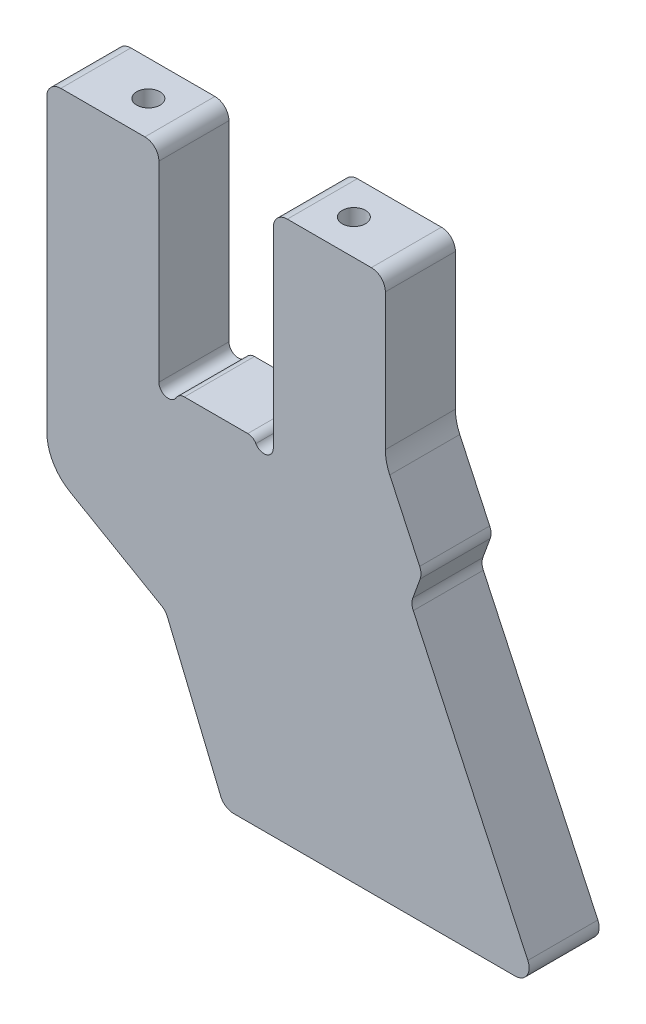
ISO-10303-21;
HEADER;
FILE_DESCRIPTION(('STEP AP214'),'2;1');
FILE_NAME('part.step','',(''),(''),'','','');
FILE_SCHEMA(('AUTOMOTIVE_DESIGN { 1 0 10303 214 1 1 1 1 }'));
ENDSEC;
DATA;
#1=APPLICATION_CONTEXT('core data for automotive mechanical design processes');
#2=APPLICATION_PROTOCOL_DEFINITION('international standard','automotive_design',2000,#1);
#3=PRODUCT_CONTEXT('',#1,'mechanical');
#4=PRODUCT('Part','Part','',(#3));
#5=PRODUCT_RELATED_PRODUCT_CATEGORY('part','',(#4));
#6=PRODUCT_DEFINITION_FORMATION('','',#4);
#7=PRODUCT_DEFINITION_CONTEXT('part definition',#1,'design');
#8=PRODUCT_DEFINITION('design','',#6,#7);
#9=PRODUCT_DEFINITION_SHAPE('','',#8);
#10=(LENGTH_UNIT() NAMED_UNIT(*) SI_UNIT(.MILLI.,.METRE.));
#11=(NAMED_UNIT(*) PLANE_ANGLE_UNIT() SI_UNIT($,.RADIAN.));
#12=(NAMED_UNIT(*) SI_UNIT($,.STERADIAN.) SOLID_ANGLE_UNIT());
#13=UNCERTAINTY_MEASURE_WITH_UNIT(LENGTH_MEASURE(1.E-05),#10,'distance_accuracy_value','');
#14=(GEOMETRIC_REPRESENTATION_CONTEXT(3) GLOBAL_UNCERTAINTY_ASSIGNED_CONTEXT((#13)) GLOBAL_UNIT_ASSIGNED_CONTEXT((#10,
#11,#12)) REPRESENTATION_CONTEXT('',''));
#15=CARTESIAN_POINT('',(0.,0.,0.));
#16=DIRECTION('',(0.,0.,1.));
#17=DIRECTION('',(1.,0.,0.));
#18=AXIS2_PLACEMENT_3D('',#15,#16,#17);
#19=CARTESIAN_POINT('',(-15.25,41.,-15.));
#20=DIRECTION('',(0.,0.,1.));
#21=DIRECTION('',(1.,0.,0.));
#22=AXIS2_PLACEMENT_3D('',#19,#20,#21);
#23=CYLINDRICAL_SURFACE('',#22,3.);
#24=CARTESIAN_POINT('',(-15.25,41.,0.));
#25=DIRECTION('',(0.,0.,1.));
#26=DIRECTION('',(1.,0.,0.));
#27=AXIS2_PLACEMENT_3D('',#24,#25,#26);
#28=CIRCLE('',#27,3.);
#29=CARTESIAN_POINT('',(-12.25,41.,0.));
#30=VERTEX_POINT('',#29);
#31=CARTESIAN_POINT('',(-15.25,44.,0.));
#32=VERTEX_POINT('',#31);
#33=EDGE_CURVE('E267',#30,#32,#28,.T.);
#34=ORIENTED_EDGE('',*,*,#33,.F.);
#35=DIRECTION('',(0.,0.,1.));
#36=VECTOR('',#35,1.);
#37=CARTESIAN_POINT('',(-12.25,41.,-15.));
#38=LINE('',#37,#36);
#39=CARTESIAN_POINT('',(-12.25,41.,-15.));
#40=VERTEX_POINT('',#39);
#41=EDGE_CURVE('E11',#40,#30,#38,.T.);
#42=ORIENTED_EDGE('',*,*,#41,.F.);
#43=CARTESIAN_POINT('',(-15.25,41.,-15.));
#44=DIRECTION('',(0.,0.,1.));
#45=DIRECTION('',(1.,0.,0.));
#46=AXIS2_PLACEMENT_3D('',#43,#44,#45);
#47=CIRCLE('',#46,3.);
#48=CARTESIAN_POINT('',(-15.25,44.,-15.));
#49=VERTEX_POINT('',#48);
#50=EDGE_CURVE('E348',#40,#49,#47,.T.);
#51=ORIENTED_EDGE('',*,*,#50,.T.);
#52=DIRECTION('',(0.,0.,1.));
#53=VECTOR('',#52,1.);
#54=CARTESIAN_POINT('',(-15.25,44.,-15.));
#55=LINE('',#54,#53);
#56=EDGE_CURVE('E50',#49,#32,#55,.T.);
#57=ORIENTED_EDGE('',*,*,#56,.T.);
#58=EDGE_LOOP('',(#34,#42,#51,#57));
#59=FACE_BOUND('',#58,.T.);
#60=ADVANCED_FACE('F47',(#59),#23,.T.);
#61=CARTESIAN_POINT('',(-12.25,41.,-15.));
#62=DIRECTION('',(1.,0.,0.));
#63=DIRECTION('',(0.,1.,0.));
#64=AXIS2_PLACEMENT_3D('',#61,#62,#63);
#65=PLANE('',#64);
#66=DIRECTION('',(0.,1.,0.));
#67=VECTOR('',#66,1.);
#68=CARTESIAN_POINT('',(-12.25,41.,0.));
#69=LINE('',#68,#67);
#70=CARTESIAN_POINT('',(-12.25,0.,0.));
#71=VERTEX_POINT('',#70);
#72=EDGE_CURVE('E346',#71,#30,#69,.T.);
#73=ORIENTED_EDGE('',*,*,#72,.F.);
#74=DIRECTION('',(0.,0.,1.));
#75=VECTOR('',#74,1.);
#76=CARTESIAN_POINT('',(-12.25,0.,-15.));
#77=LINE('',#76,#75);
#78=CARTESIAN_POINT('',(-12.25,0.,-15.));
#79=VERTEX_POINT('',#78);
#80=EDGE_CURVE('E56',#79,#71,#77,.T.);
#81=ORIENTED_EDGE('',*,*,#80,.F.);
#82=DIRECTION('',(0.,1.,0.));
#83=VECTOR('',#82,1.);
#84=CARTESIAN_POINT('',(-12.25,41.,-15.));
#85=LINE('',#84,#83);
#86=EDGE_CURVE('E257',#79,#40,#85,.T.);
#87=ORIENTED_EDGE('',*,*,#86,.T.);
#88=ORIENTED_EDGE('',*,*,#41,.T.);
#89=EDGE_LOOP('',(#73,#81,#87,#88));
#90=FACE_BOUND('',#89,.T.);
#91=ADVANCED_FACE('F400',(#90),#65,.T.);
#92=CARTESIAN_POINT('',(-10.25,0.,-15.));
#93=DIRECTION('',(0.,0.,1.));
#94=DIRECTION('',(1.,0.,0.));
#95=AXIS2_PLACEMENT_3D('',#92,#93,#94);
#96=CYLINDRICAL_SURFACE('',#95,2.);
#97=CARTESIAN_POINT('',(-10.25,0.,0.));
#98=DIRECTION('',(0.,0.,-1.));
#99=DIRECTION('',(1.,0.,0.));
#100=AXIS2_PLACEMENT_3D('',#97,#98,#99);
#101=CIRCLE('',#100,2.);
#102=CARTESIAN_POINT('',(-8.51794919243112,-1.,0.));
#103=VERTEX_POINT('',#102);
#104=EDGE_CURVE('E244',#103,#71,#101,.T.);
#105=ORIENTED_EDGE('',*,*,#104,.F.);
#106=DIRECTION('',(0.,0.,1.));
#107=VECTOR('',#106,1.);
#108=CARTESIAN_POINT('',(-8.51794919243112,-1.,-15.));
#109=LINE('',#108,#107);
#110=CARTESIAN_POINT('',(-8.51794919243112,-1.,-15.));
#111=VERTEX_POINT('',#110);
#112=EDGE_CURVE('E239',#111,#103,#109,.T.);
#113=ORIENTED_EDGE('',*,*,#112,.F.);
#114=CARTESIAN_POINT('',(-10.25,0.,-15.));
#115=DIRECTION('',(0.,0.,-1.));
#116=DIRECTION('',(1.,0.,0.));
#117=AXIS2_PLACEMENT_3D('',#114,#115,#116);
#118=CIRCLE('',#117,2.);
#119=EDGE_CURVE('E242',#111,#79,#118,.T.);
#120=ORIENTED_EDGE('',*,*,#119,.T.);
#121=ORIENTED_EDGE('',*,*,#80,.T.);
#122=EDGE_LOOP('',(#105,#113,#120,#121));
#123=FACE_BOUND('',#122,.T.);
#124=ADVANCED_FACE('F241',(#123),#96,.F.);
#125=CARTESIAN_POINT('',(-6.78589838486224,-2.,-15.));
#126=DIRECTION('',(0.,0.,1.));
#127=DIRECTION('',(1.,0.,0.));
#128=AXIS2_PLACEMENT_3D('',#125,#126,#127);
#129=CYLINDRICAL_SURFACE('',#128,2.);
#130=CARTESIAN_POINT('',(-6.78589838486224,-2.,0.));
#131=DIRECTION('',(0.,0.,1.));
#132=DIRECTION('',(-1.,0.,0.));
#133=AXIS2_PLACEMENT_3D('',#130,#131,#132);
#134=CIRCLE('',#133,2.);
#135=CARTESIAN_POINT('',(-6.78589838486224,0.,0.));
#136=VERTEX_POINT('',#135);
#137=EDGE_CURVE('E343',#136,#103,#134,.T.);
#138=ORIENTED_EDGE('',*,*,#137,.F.);
#139=DIRECTION('',(0.,0.,1.));
#140=VECTOR('',#139,1.);
#141=CARTESIAN_POINT('',(-6.78589838486224,0.,-15.));
#142=LINE('',#141,#140);
#143=CARTESIAN_POINT('',(-6.78589838486224,0.,-15.));
#144=VERTEX_POINT('',#143);
#145=EDGE_CURVE('E249',#144,#136,#142,.T.);
#146=ORIENTED_EDGE('',*,*,#145,.F.);
#147=CARTESIAN_POINT('',(-6.78589838486224,-2.,-15.));
#148=DIRECTION('',(0.,0.,1.));
#149=DIRECTION('',(-1.,0.,0.));
#150=AXIS2_PLACEMENT_3D('',#147,#148,#149);
#151=CIRCLE('',#150,2.);
#152=EDGE_CURVE('E255',#144,#111,#151,.T.);
#153=ORIENTED_EDGE('',*,*,#152,.T.);
#154=ORIENTED_EDGE('',*,*,#112,.T.);
#155=EDGE_LOOP('',(#138,#146,#153,#154));
#156=FACE_BOUND('',#155,.T.);
#157=ADVANCED_FACE('F259',(#156),#129,.T.);
#158=CARTESIAN_POINT('',(6.78589838486224,0.,-15.));
#159=DIRECTION('',(0.,1.,0.));
#160=DIRECTION('',(0.,0.,1.));
#161=AXIS2_PLACEMENT_3D('',#158,#159,#160);
#162=PLANE('',#161);
#163=DIRECTION('',(-1.,0.,0.));
#164=VECTOR('',#163,1.);
#165=CARTESIAN_POINT('',(6.78589838486224,0.,0.));
#166=LINE('',#165,#164);
#167=CARTESIAN_POINT('',(6.78589838486224,0.,0.));
#168=VERTEX_POINT('',#167);
#169=EDGE_CURVE('E340',#168,#136,#166,.T.);
#170=ORIENTED_EDGE('',*,*,#169,.F.);
#171=DIRECTION('',(0.,0.,1.));
#172=VECTOR('',#171,1.);
#173=CARTESIAN_POINT('',(6.78589838486224,0.,-15.));
#174=LINE('',#173,#172);
#175=CARTESIAN_POINT('',(6.78589838486224,0.,-15.));
#176=VERTEX_POINT('',#175);
#177=EDGE_CURVE('E352',#176,#168,#174,.T.);
#178=ORIENTED_EDGE('',*,*,#177,.F.);
#179=DIRECTION('',(-1.,0.,0.));
#180=VECTOR('',#179,1.);
#181=CARTESIAN_POINT('',(6.78589838486224,0.,-15.));
#182=LINE('',#181,#180);
#183=EDGE_CURVE('E260',#176,#144,#182,.T.);
#184=ORIENTED_EDGE('',*,*,#183,.T.);
#185=ORIENTED_EDGE('',*,*,#145,.T.);
#186=EDGE_LOOP('',(#170,#178,#184,#185));
#187=FACE_BOUND('',#186,.T.);
#188=ADVANCED_FACE('F413',(#187),#162,.T.);
#189=CARTESIAN_POINT('',(6.78589838486224,-2.,-15.));
#190=DIRECTION('',(0.,0.,1.));
#191=DIRECTION('',(1.,0.,0.));
#192=AXIS2_PLACEMENT_3D('',#189,#190,#191);
#193=CYLINDRICAL_SURFACE('',#192,2.);
#194=CARTESIAN_POINT('',(6.78589838486224,-2.,0.));
#195=DIRECTION('',(0.,0.,1.));
#196=DIRECTION('',(1.,0.,0.));
#197=AXIS2_PLACEMENT_3D('',#194,#195,#196);
#198=CIRCLE('',#197,2.);
#199=CARTESIAN_POINT('',(8.51794919243112,-1.,0.));
#200=VERTEX_POINT('',#199);
#201=EDGE_CURVE('E337',#200,#168,#198,.T.);
#202=ORIENTED_EDGE('',*,*,#201,.F.);
#203=DIRECTION('',(0.,0.,1.));
#204=VECTOR('',#203,1.);
#205=CARTESIAN_POINT('',(8.51794919243112,-1.,-15.));
#206=LINE('',#205,#204);
#207=CARTESIAN_POINT('',(8.51794919243112,-1.,-15.));
#208=VERTEX_POINT('',#207);
#209=EDGE_CURVE('E354',#208,#200,#206,.T.);
#210=ORIENTED_EDGE('',*,*,#209,.F.);
#211=CARTESIAN_POINT('',(6.78589838486224,-2.,-15.));
#212=DIRECTION('',(0.,0.,1.));
#213=DIRECTION('',(1.,0.,0.));
#214=AXIS2_PLACEMENT_3D('',#211,#212,#213);
#215=CIRCLE('',#214,2.);
#216=EDGE_CURVE('E262',#208,#176,#215,.T.);
#217=ORIENTED_EDGE('',*,*,#216,.T.);
#218=ORIENTED_EDGE('',*,*,#177,.T.);
#219=EDGE_LOOP('',(#202,#210,#217,#218));
#220=FACE_BOUND('',#219,.T.);
#221=ADVANCED_FACE('F416',(#220),#193,.T.);
#222=CARTESIAN_POINT('',(10.25,0.,-15.));
#223=DIRECTION('',(0.,0.,1.));
#224=DIRECTION('',(1.,0.,0.));
#225=AXIS2_PLACEMENT_3D('',#222,#223,#224);
#226=CYLINDRICAL_SURFACE('',#225,2.);
#227=CARTESIAN_POINT('',(10.25,0.,0.));
#228=DIRECTION('',(0.,0.,-1.));
#229=DIRECTION('',(-1.,0.,0.));
#230=AXIS2_PLACEMENT_3D('',#227,#228,#229);
#231=CIRCLE('',#230,2.);
#232=CARTESIAN_POINT('',(12.25,0.,0.));
#233=VERTEX_POINT('',#232);
#234=EDGE_CURVE('E334',#233,#200,#231,.T.);
#235=ORIENTED_EDGE('',*,*,#234,.F.);
#236=DIRECTION('',(0.,0.,1.));
#237=VECTOR('',#236,1.);
#238=CARTESIAN_POINT('',(12.25,0.,-15.));
#239=LINE('',#238,#237);
#240=CARTESIAN_POINT('',(12.25,0.,-15.));
#241=VERTEX_POINT('',#240);
#242=EDGE_CURVE('E356',#241,#233,#239,.T.);
#243=ORIENTED_EDGE('',*,*,#242,.F.);
#244=CARTESIAN_POINT('',(10.25,0.,-15.));
#245=DIRECTION('',(0.,0.,-1.));
#246=DIRECTION('',(-1.,0.,0.));
#247=AXIS2_PLACEMENT_3D('',#244,#245,#246);
#248=CIRCLE('',#247,2.);
#249=EDGE_CURVE('E587',#241,#208,#248,.T.);
#250=ORIENTED_EDGE('',*,*,#249,.T.);
#251=ORIENTED_EDGE('',*,*,#209,.T.);
#252=EDGE_LOOP('',(#235,#243,#250,#251));
#253=FACE_BOUND('',#252,.T.);
#254=ADVANCED_FACE('F420',(#253),#226,.F.);
#255=CARTESIAN_POINT('',(12.25,41.,-15.));
#256=DIRECTION('',(-1.,0.,0.));
#257=DIRECTION('',(0.,-1.,0.));
#258=AXIS2_PLACEMENT_3D('',#255,#256,#257);
#259=PLANE('',#258);
#260=DIRECTION('',(0.,-1.,0.));
#261=VECTOR('',#260,1.);
#262=CARTESIAN_POINT('',(12.25,41.,0.));
#263=LINE('',#262,#261);
#264=CARTESIAN_POINT('',(12.25,41.,0.));
#265=VERTEX_POINT('',#264);
#266=EDGE_CURVE('E331',#265,#233,#263,.T.);
#267=ORIENTED_EDGE('',*,*,#266,.F.);
#268=DIRECTION('',(0.,0.,1.));
#269=VECTOR('',#268,1.);
#270=CARTESIAN_POINT('',(12.25,41.,-15.));
#271=LINE('',#270,#269);
#272=CARTESIAN_POINT('',(12.25,41.,-15.));
#273=VERTEX_POINT('',#272);
#274=EDGE_CURVE('E358',#273,#265,#271,.T.);
#275=ORIENTED_EDGE('',*,*,#274,.F.);
#276=DIRECTION('',(0.,-1.,0.));
#277=VECTOR('',#276,1.);
#278=CARTESIAN_POINT('',(12.25,41.,-15.));
#279=LINE('',#278,#277);
#280=EDGE_CURVE('E584',#273,#241,#279,.T.);
#281=ORIENTED_EDGE('',*,*,#280,.T.);
#282=ORIENTED_EDGE('',*,*,#242,.T.);
#283=EDGE_LOOP('',(#267,#275,#281,#282));
#284=FACE_BOUND('',#283,.T.);
#285=ADVANCED_FACE('F424',(#284),#259,.T.);
#286=CARTESIAN_POINT('',(15.25,41.,-15.));
#287=DIRECTION('',(0.,0.,1.));
#288=DIRECTION('',(1.,0.,0.));
#289=AXIS2_PLACEMENT_3D('',#286,#287,#288);
#290=CYLINDRICAL_SURFACE('',#289,3.);
#291=CARTESIAN_POINT('',(15.25,41.,0.));
#292=DIRECTION('',(0.,0.,1.));
#293=DIRECTION('',(-1.,0.,0.));
#294=AXIS2_PLACEMENT_3D('',#291,#292,#293);
#295=CIRCLE('',#294,3.);
#296=CARTESIAN_POINT('',(15.25,44.,0.));
#297=VERTEX_POINT('',#296);
#298=EDGE_CURVE('E328',#297,#265,#295,.T.);
#299=ORIENTED_EDGE('',*,*,#298,.F.);
#300=DIRECTION('',(0.,0.,1.));
#301=VECTOR('',#300,1.);
#302=CARTESIAN_POINT('',(15.25,44.,-15.));
#303=LINE('',#302,#301);
#304=CARTESIAN_POINT('',(15.25,44.,-15.));
#305=VERTEX_POINT('',#304);
#306=EDGE_CURVE('E360',#305,#297,#303,.T.);
#307=ORIENTED_EDGE('',*,*,#306,.F.);
#308=CARTESIAN_POINT('',(15.25,41.,-15.));
#309=DIRECTION('',(0.,0.,1.));
#310=DIRECTION('',(-1.,0.,0.));
#311=AXIS2_PLACEMENT_3D('',#308,#309,#310);
#312=CIRCLE('',#311,3.);
#313=EDGE_CURVE('E581',#305,#273,#312,.T.);
#314=ORIENTED_EDGE('',*,*,#313,.T.);
#315=ORIENTED_EDGE('',*,*,#274,.T.);
#316=EDGE_LOOP('',(#299,#307,#314,#315));
#317=FACE_BOUND('',#316,.T.);
#318=ADVANCED_FACE('F428',(#317),#290,.T.);
#319=CARTESIAN_POINT('',(33.25,44.,-15.));
#320=DIRECTION('',(0.,1.,0.));
#321=DIRECTION('',(-1.,0.,0.));
#322=AXIS2_PLACEMENT_3D('',#319,#320,#321);
#323=PLANE('',#322);
#324=CARTESIAN_POINT('',(22.,44.,-7.50000000000001));
#325=DIRECTION('',(0.,1.,0.));
#326=DIRECTION('',(0.,0.,1.));
#327=AXIS2_PLACEMENT_3D('',#324,#325,#326);
#328=CIRCLE('',#327,2.5);
#329=CARTESIAN_POINT('',(22.,44.,-5.00000000000001));
#330=VERTEX_POINT('',#329);
#331=EDGE_CURVE('E517',#330,#330,#328,.T.);
#332=ORIENTED_EDGE('',*,*,#331,.F.);
#333=EDGE_LOOP('',(#332));
#334=FACE_BOUND('',#333,.T.);
#335=DIRECTION('',(-1.,0.,0.));
#336=VECTOR('',#335,1.);
#337=CARTESIAN_POINT('',(33.25,44.,0.));
#338=LINE('',#337,#336);
#339=CARTESIAN_POINT('',(33.25,44.,0.));
#340=VERTEX_POINT('',#339);
#341=EDGE_CURVE('E325',#340,#297,#338,.T.);
#342=ORIENTED_EDGE('',*,*,#341,.F.);
#343=DIRECTION('',(0.,0.,1.));
#344=VECTOR('',#343,1.);
#345=CARTESIAN_POINT('',(33.25,44.,-15.));
#346=LINE('',#345,#344);
#347=CARTESIAN_POINT('',(33.25,44.,-15.));
#348=VERTEX_POINT('',#347);
#349=EDGE_CURVE('E362',#348,#340,#346,.T.);
#350=ORIENTED_EDGE('',*,*,#349,.F.);
#351=DIRECTION('',(-1.,0.,0.));
#352=VECTOR('',#351,1.);
#353=CARTESIAN_POINT('',(33.25,44.,-15.));
#354=LINE('',#353,#352);
#355=EDGE_CURVE('E578',#348,#305,#354,.T.);
#356=ORIENTED_EDGE('',*,*,#355,.T.);
#357=ORIENTED_EDGE('',*,*,#306,.T.);
#358=EDGE_LOOP('',(#342,#350,#356,#357));
#359=FACE_BOUND('',#358,.T.);
#360=ADVANCED_FACE('F432',(#334,#359),#323,.T.);
#361=CARTESIAN_POINT('',(33.25,41.,-15.));
#362=DIRECTION('',(0.,0.,1.));
#363=DIRECTION('',(1.,0.,0.));
#364=AXIS2_PLACEMENT_3D('',#361,#362,#363);
#365=CYLINDRICAL_SURFACE('',#364,3.00000000000001);
#366=CARTESIAN_POINT('',(33.25,41.,0.));
#367=DIRECTION('',(0.,0.,1.));
#368=DIRECTION('',(1.,0.,0.));
#369=AXIS2_PLACEMENT_3D('',#366,#367,#368);
#370=CIRCLE('',#369,3.00000000000001);
#371=CARTESIAN_POINT('',(36.25,41.,0.));
#372=VERTEX_POINT('',#371);
#373=EDGE_CURVE('E322',#372,#340,#370,.T.);
#374=ORIENTED_EDGE('',*,*,#373,.F.);
#375=DIRECTION('',(0.,0.,1.));
#376=VECTOR('',#375,1.);
#377=CARTESIAN_POINT('',(36.25,41.,-15.));
#378=LINE('',#377,#376);
#379=CARTESIAN_POINT('',(36.25,41.,-15.));
#380=VERTEX_POINT('',#379);
#381=EDGE_CURVE('E364',#380,#372,#378,.T.);
#382=ORIENTED_EDGE('',*,*,#381,.F.);
#383=CARTESIAN_POINT('',(33.25,41.,-15.));
#384=DIRECTION('',(0.,0.,1.));
#385=DIRECTION('',(1.,0.,0.));
#386=AXIS2_PLACEMENT_3D('',#383,#384,#385);
#387=CIRCLE('',#386,3.00000000000001);
#388=EDGE_CURVE('E575',#380,#348,#387,.T.);
#389=ORIENTED_EDGE('',*,*,#388,.T.);
#390=ORIENTED_EDGE('',*,*,#349,.T.);
#391=EDGE_LOOP('',(#374,#382,#389,#390));
#392=FACE_BOUND('',#391,.T.);
#393=ADVANCED_FACE('F436',(#392),#365,.T.);
#394=CARTESIAN_POINT('',(36.25,11.7444294587335,-15.));
#395=DIRECTION('',(1.,0.,0.));
#396=DIRECTION('',(0.,1.,0.));
#397=AXIS2_PLACEMENT_3D('',#394,#395,#396);
#398=PLANE('',#397);
#399=DIRECTION('',(0.,1.,0.));
#400=VECTOR('',#399,1.);
#401=CARTESIAN_POINT('',(36.25,11.7444294587335,0.));
#402=LINE('',#401,#400);
#403=CARTESIAN_POINT('',(36.25,11.7444294587335,0.));
#404=VERTEX_POINT('',#403);
#405=EDGE_CURVE('E319',#404,#372,#402,.T.);
#406=ORIENTED_EDGE('',*,*,#405,.F.);
#407=DIRECTION('',(0.,0.,1.));
#408=VECTOR('',#407,1.);
#409=CARTESIAN_POINT('',(36.25,11.7444294587335,-15.));
#410=LINE('',#409,#408);
#411=CARTESIAN_POINT('',(36.25,11.7444294587335,-15.));
#412=VERTEX_POINT('',#411);
#413=EDGE_CURVE('E366',#412,#404,#410,.T.);
#414=ORIENTED_EDGE('',*,*,#413,.F.);
#415=DIRECTION('',(0.,1.,0.));
#416=VECTOR('',#415,1.);
#417=CARTESIAN_POINT('',(36.25,11.7444294587335,-15.));
#418=LINE('',#417,#416);
#419=EDGE_CURVE('E572',#412,#380,#418,.T.);
#420=ORIENTED_EDGE('',*,*,#419,.T.);
#421=ORIENTED_EDGE('',*,*,#381,.T.);
#422=EDGE_LOOP('',(#406,#414,#420,#421));
#423=FACE_BOUND('',#422,.T.);
#424=ADVANCED_FACE('F440',(#423),#398,.T.);
#425=CARTESIAN_POINT('',(46.25,11.7444294587335,-15.));
#426=DIRECTION('',(0.,0.,1.));
#427=DIRECTION('',(1.,0.,0.));
#428=AXIS2_PLACEMENT_3D('',#425,#426,#427);
#429=CYLINDRICAL_SURFACE('',#428,10.);
#430=CARTESIAN_POINT('',(46.25,11.7444294587335,0.));
#431=DIRECTION('',(0.,0.,-1.));
#432=DIRECTION('',(-1.,0.,0.));
#433=AXIS2_PLACEMENT_3D('',#430,#431,#432);
#434=CIRCLE('',#433,10.);
#435=CARTESIAN_POINT('',(37.1869221296339,7.51824684132561,0.));
#436=VERTEX_POINT('',#435);
#437=EDGE_CURVE('E316',#436,#404,#434,.T.);
#438=ORIENTED_EDGE('',*,*,#437,.F.);
#439=DIRECTION('',(0.,0.,1.));
#440=VECTOR('',#439,1.);
#441=CARTESIAN_POINT('',(37.1869221296339,7.51824684132561,-15.));
#442=LINE('',#441,#440);
#443=CARTESIAN_POINT('',(37.1869221296339,7.51824684132561,-15.));
#444=VERTEX_POINT('',#443);
#445=EDGE_CURVE('E368',#444,#436,#442,.T.);
#446=ORIENTED_EDGE('',*,*,#445,.F.);
#447=CARTESIAN_POINT('',(46.25,11.7444294587335,-15.));
#448=DIRECTION('',(0.,0.,-1.));
#449=DIRECTION('',(-1.,0.,0.));
#450=AXIS2_PLACEMENT_3D('',#447,#448,#449);
#451=CIRCLE('',#450,10.);
#452=EDGE_CURVE('E569',#444,#412,#451,.T.);
#453=ORIENTED_EDGE('',*,*,#452,.T.);
#454=ORIENTED_EDGE('',*,*,#413,.T.);
#455=EDGE_LOOP('',(#438,#446,#453,#454));
#456=FACE_BOUND('',#455,.T.);
#457=ADVANCED_FACE('F444',(#456),#429,.F.);
#458=CARTESIAN_POINT('',(43.5974408063238,-6.22915482488828,-15.));
#459=DIRECTION('',(0.90630778703661,0.422618261740785,0.));
#460=DIRECTION('',(-0.422618261740785,0.90630778703661,0.));
#461=AXIS2_PLACEMENT_3D('',#458,#459,#460);
#462=PLANE('',#461);
#463=DIRECTION('',(-0.422618261740785,0.90630778703661,0.));
#464=VECTOR('',#463,1.);
#465=CARTESIAN_POINT('',(43.5974408063238,-6.22915482488828,0.));
#466=LINE('',#465,#464);
#467=CARTESIAN_POINT('',(43.5974408063238,-6.22915482488828,0.));
#468=VERTEX_POINT('',#467);
#469=EDGE_CURVE('E313',#468,#436,#466,.T.);
#470=ORIENTED_EDGE('',*,*,#469,.F.);
#471=DIRECTION('',(0.,0.,1.));
#472=VECTOR('',#471,1.);
#473=CARTESIAN_POINT('',(43.5974408063238,-6.22915482488828,-15.));
#474=LINE('',#473,#472);
#475=CARTESIAN_POINT('',(43.5974408063238,-6.22915482488828,-15.));
#476=VERTEX_POINT('',#475);
#477=EDGE_CURVE('E370',#476,#468,#474,.T.);
#478=ORIENTED_EDGE('',*,*,#477,.F.);
#479=DIRECTION('',(-0.422618261740785,0.90630778703661,0.));
#480=VECTOR('',#479,1.);
#481=CARTESIAN_POINT('',(43.5974408063238,-6.22915482488828,-15.));
#482=LINE('',#481,#480);
#483=EDGE_CURVE('E566',#476,#444,#482,.T.);
#484=ORIENTED_EDGE('',*,*,#483,.T.);
#485=ORIENTED_EDGE('',*,*,#445,.T.);
#486=EDGE_LOOP('',(#470,#478,#484,#485));
#487=FACE_BOUND('',#486,.T.);
#488=ADVANCED_FACE('F448',(#487),#462,.T.);
#489=CARTESIAN_POINT('',(40.878517445214,-7.49700961011063,-15.));
#490=DIRECTION('',(0.,0.,1.));
#491=DIRECTION('',(1.,0.,0.));
#492=AXIS2_PLACEMENT_3D('',#489,#490,#491);
#493=CYLINDRICAL_SURFACE('',#492,2.99999999999999);
#494=CARTESIAN_POINT('',(40.878517445214,-7.49700961011063,0.));
#495=DIRECTION('',(0.,0.,1.));
#496=DIRECTION('',(1.,0.,0.));
#497=AXIS2_PLACEMENT_3D('',#494,#495,#496);
#498=CIRCLE('',#497,2.99999999999999);
#499=CARTESIAN_POINT('',(43.6975953075718,-8.52307004008736,0.));
#500=VERTEX_POINT('',#499);
#501=EDGE_CURVE('E310',#500,#468,#498,.T.);
#502=ORIENTED_EDGE('',*,*,#501,.F.);
#503=DIRECTION('',(0.,0.,1.));
#504=VECTOR('',#503,1.);
#505=CARTESIAN_POINT('',(43.6975953075718,-8.52307004008736,-15.));
#506=LINE('',#505,#504);
#507=CARTESIAN_POINT('',(43.6975953075718,-8.52307004008736,-15.));
#508=VERTEX_POINT('',#507);
#509=EDGE_CURVE('E372',#508,#500,#506,.T.);
#510=ORIENTED_EDGE('',*,*,#509,.F.);
#511=CARTESIAN_POINT('',(40.878517445214,-7.49700961011063,-15.));
#512=DIRECTION('',(0.,0.,1.));
#513=DIRECTION('',(1.,0.,0.));
#514=AXIS2_PLACEMENT_3D('',#511,#512,#513);
#515=CIRCLE('',#514,2.99999999999999);
#516=EDGE_CURVE('E563',#508,#476,#515,.T.);
#517=ORIENTED_EDGE('',*,*,#516,.T.);
#518=ORIENTED_EDGE('',*,*,#477,.T.);
#519=EDGE_LOOP('',(#502,#510,#517,#518));
#520=FACE_BOUND('',#519,.T.);
#521=ADVANCED_FACE('F452',(#520),#493,.T.);
#522=CARTESIAN_POINT('',(42.1291639729142,-12.8322997160256,-15.));
#523=DIRECTION('',(0.939692620785941,-0.342020143325578,0.));
#524=DIRECTION('',(0.342020143325578,0.939692620785941,0.));
#525=AXIS2_PLACEMENT_3D('',#522,#523,#524);
#526=PLANE('',#525);
#527=DIRECTION('',(0.342020143325578,0.939692620785941,0.));
#528=VECTOR('',#527,1.);
#529=CARTESIAN_POINT('',(42.1291639729142,-12.8322997160256,0.));
#530=LINE('',#529,#528);
#531=CARTESIAN_POINT('',(42.1291639729142,-12.8322997160256,0.));
#532=VERTEX_POINT('',#531);
#533=EDGE_CURVE('E307',#532,#500,#530,.T.);
#534=ORIENTED_EDGE('',*,*,#533,.F.);
#535=DIRECTION('',(0.,0.,1.));
#536=VECTOR('',#535,1.);
#537=CARTESIAN_POINT('',(42.1291639729142,-12.8322997160256,-15.));
#538=LINE('',#537,#536);
#539=CARTESIAN_POINT('',(42.1291639729142,-12.8322997160256,-15.));
#540=VERTEX_POINT('',#539);
#541=EDGE_CURVE('E374',#540,#532,#538,.T.);
#542=ORIENTED_EDGE('',*,*,#541,.F.);
#543=DIRECTION('',(0.342020143325578,0.939692620785941,0.));
#544=VECTOR('',#543,1.);
#545=CARTESIAN_POINT('',(42.1291639729142,-12.8322997160256,-15.));
#546=LINE('',#545,#544);
#547=EDGE_CURVE('E560',#540,#508,#546,.T.);
#548=ORIENTED_EDGE('',*,*,#547,.T.);
#549=ORIENTED_EDGE('',*,*,#509,.T.);
#550=EDGE_LOOP('',(#534,#542,#548,#549));
#551=FACE_BOUND('',#550,.T.);
#552=ADVANCED_FACE('F456',(#551),#526,.T.);
#553=CARTESIAN_POINT('',(44.948241835272,-13.8583601460024,-15.));
#554=DIRECTION('',(0.,0.,1.));
#555=DIRECTION('',(1.,0.,0.));
#556=AXIS2_PLACEMENT_3D('',#553,#554,#555);
#557=CYLINDRICAL_SURFACE('',#556,2.99999999999999);
#558=CARTESIAN_POINT('',(44.948241835272,-13.8583601460024,0.));
#559=DIRECTION('',(0.,0.,-1.));
#560=DIRECTION('',(1.,0.,0.));
#561=AXIS2_PLACEMENT_3D('',#558,#559,#560);
#562=CIRCLE('',#561,2.99999999999999);
#563=CARTESIAN_POINT('',(42.2293184741621,-15.1262149312247,0.));
#564=VERTEX_POINT('',#563);
#565=EDGE_CURVE('E304',#564,#532,#562,.T.);
#566=ORIENTED_EDGE('',*,*,#565,.F.);
#567=DIRECTION('',(0.,0.,1.));
#568=VECTOR('',#567,1.);
#569=CARTESIAN_POINT('',(42.2293184741621,-15.1262149312247,-15.));
#570=LINE('',#569,#568);
#571=CARTESIAN_POINT('',(42.2293184741621,-15.1262149312247,-15.));
#572=VERTEX_POINT('',#571);
#573=EDGE_CURVE('E376',#572,#564,#570,.T.);
#574=ORIENTED_EDGE('',*,*,#573,.F.);
#575=CARTESIAN_POINT('',(44.948241835272,-13.8583601460024,-15.));
#576=DIRECTION('',(0.,0.,-1.));
#577=DIRECTION('',(1.,0.,0.));
#578=AXIS2_PLACEMENT_3D('',#575,#576,#577);
#579=CIRCLE('',#578,2.99999999999999);
#580=EDGE_CURVE('E557',#572,#540,#579,.T.);
#581=ORIENTED_EDGE('',*,*,#580,.T.);
#582=ORIENTED_EDGE('',*,*,#541,.T.);
#583=EDGE_LOOP('',(#566,#574,#581,#582));
#584=FACE_BOUND('',#583,.T.);
#585=ADVANCED_FACE('F460',(#584),#557,.F.);
#586=CARTESIAN_POINT('',(42.2293184741621,-15.1262149312247,-15.));
#587=DIRECTION('',(0.90630778703661,0.422618261740785,0.));
#588=DIRECTION('',(-0.422618261740785,0.90630778703661,0.));
#589=AXIS2_PLACEMENT_3D('',#586,#587,#588);
#590=PLANE('',#589);
#591=DIRECTION('',(-0.422618261740785,0.90630778703661,0.));
#592=VECTOR('',#591,1.);
#593=CARTESIAN_POINT('',(42.2293184741621,-15.1262149312247,0.));
#594=LINE('',#593,#592);
#595=CARTESIAN_POINT('',(66.7598666297569,-67.7321452147776,0.));
#596=VERTEX_POINT('',#595);
#597=EDGE_CURVE('E301',#596,#564,#594,.T.);
#598=ORIENTED_EDGE('',*,*,#597,.F.);
#599=DIRECTION('',(0.,0.,1.));
#600=VECTOR('',#599,1.);
#601=CARTESIAN_POINT('',(66.7598666297569,-67.7321452147776,-15.));
#602=LINE('',#601,#600);
#603=CARTESIAN_POINT('',(66.7598666297569,-67.7321452147776,-15.));
#604=VERTEX_POINT('',#603);
#605=EDGE_CURVE('E378',#604,#596,#602,.T.);
#606=ORIENTED_EDGE('',*,*,#605,.F.);
#607=DIRECTION('',(-0.422618261740785,0.90630778703661,0.));
#608=VECTOR('',#607,1.);
#609=CARTESIAN_POINT('',(42.2293184741621,-15.1262149312247,-15.));
#610=LINE('',#609,#608);
#611=EDGE_CURVE('E554',#604,#572,#610,.T.);
#612=ORIENTED_EDGE('',*,*,#611,.T.);
#613=ORIENTED_EDGE('',*,*,#573,.T.);
#614=EDGE_LOOP('',(#598,#606,#612,#613));
#615=FACE_BOUND('',#614,.T.);
#616=ADVANCED_FACE('F464',(#615),#590,.T.);
#617=CARTESIAN_POINT('',(64.0409432686473,-69.,-15.));
#618=DIRECTION('',(0.,0.,1.));
#619=DIRECTION('',(1.,0.,0.));
#620=AXIS2_PLACEMENT_3D('',#617,#618,#619);
#621=CYLINDRICAL_SURFACE('',#620,2.99999999999989);
#622=CARTESIAN_POINT('',(64.0409432686473,-69.,0.));
#623=DIRECTION('',(0.,0.,1.));
#624=DIRECTION('',(1.,0.,0.));
#625=AXIS2_PLACEMENT_3D('',#622,#623,#624);
#626=CIRCLE('',#625,2.99999999999989);
#627=CARTESIAN_POINT('',(64.0409432686471,-71.9999999999999,0.));
#628=VERTEX_POINT('',#627);
#629=EDGE_CURVE('E298',#628,#596,#626,.T.);
#630=ORIENTED_EDGE('',*,*,#629,.F.);
#631=DIRECTION('',(0.,0.,1.));
#632=VECTOR('',#631,1.);
#633=CARTESIAN_POINT('',(64.0409432686471,-71.9999999999999,-15.));
#634=LINE('',#633,#632);
#635=CARTESIAN_POINT('',(64.0409432686471,-71.9999999999999,-15.));
#636=VERTEX_POINT('',#635);
#637=EDGE_CURVE('E380',#636,#628,#634,.T.);
#638=ORIENTED_EDGE('',*,*,#637,.F.);
#639=CARTESIAN_POINT('',(64.0409432686473,-69.,-15.));
#640=DIRECTION('',(0.,0.,1.));
#641=DIRECTION('',(1.,0.,0.));
#642=AXIS2_PLACEMENT_3D('',#639,#640,#641);
#643=CIRCLE('',#642,2.99999999999989);
#644=EDGE_CURVE('E551',#636,#604,#643,.T.);
#645=ORIENTED_EDGE('',*,*,#644,.T.);
#646=ORIENTED_EDGE('',*,*,#605,.T.);
#647=EDGE_LOOP('',(#630,#638,#645,#646));
#648=FACE_BOUND('',#647,.T.);
#649=ADVANCED_FACE('F468',(#648),#621,.T.);
#650=CARTESIAN_POINT('',(3.7545359137579,-72.,-15.));
#651=DIRECTION('',(0.,-1.,0.));
#652=DIRECTION('',(1.,0.,0.));
#653=AXIS2_PLACEMENT_3D('',#650,#651,#652);
#654=PLANE('',#653);
#655=DIRECTION('',(1.,0.,0.));
#656=VECTOR('',#655,1.);
#657=CARTESIAN_POINT('',(3.7545359137579,-72.,0.));
#658=LINE('',#657,#656);
#659=CARTESIAN_POINT('',(3.7545359137579,-72.,0.));
#660=VERTEX_POINT('',#659);
#661=EDGE_CURVE('E295',#660,#628,#658,.T.);
#662=ORIENTED_EDGE('',*,*,#661,.F.);
#663=DIRECTION('',(0.,0.,1.));
#664=VECTOR('',#663,1.);
#665=CARTESIAN_POINT('',(3.7545359137579,-72.,-15.));
#666=LINE('',#665,#664);
#667=CARTESIAN_POINT('',(3.7545359137579,-72.,-15.));
#668=VERTEX_POINT('',#667);
#669=EDGE_CURVE('E382',#668,#660,#666,.T.);
#670=ORIENTED_EDGE('',*,*,#669,.F.);
#671=DIRECTION('',(1.,0.,0.));
#672=VECTOR('',#671,1.);
#673=CARTESIAN_POINT('',(3.7545359137579,-72.,-15.));
#674=LINE('',#673,#672);
#675=EDGE_CURVE('E548',#668,#636,#674,.T.);
#676=ORIENTED_EDGE('',*,*,#675,.T.);
#677=ORIENTED_EDGE('',*,*,#637,.T.);
#678=EDGE_LOOP('',(#662,#670,#676,#677));
#679=FACE_BOUND('',#678,.T.);
#680=ADVANCED_FACE('F472',(#679),#654,.T.);
#681=CARTESIAN_POINT('',(3.7545359137579,-69.,-15.));
#682=DIRECTION('',(0.,0.,1.));
#683=DIRECTION('',(1.,0.,0.));
#684=AXIS2_PLACEMENT_3D('',#681,#682,#683);
#685=CYLINDRICAL_SURFACE('',#684,3.);
#686=CARTESIAN_POINT('',(3.7545359137579,-69.,0.));
#687=DIRECTION('',(0.,0.,1.));
#688=DIRECTION('',(1.,0.,0.));
#689=AXIS2_PLACEMENT_3D('',#686,#687,#688);
#690=CIRCLE('',#689,3.);
#691=CARTESIAN_POINT('',(0.982897316224043,-70.1480502970953,0.));
#692=VERTEX_POINT('',#691);
#693=EDGE_CURVE('E292',#692,#660,#690,.T.);
#694=ORIENTED_EDGE('',*,*,#693,.F.);
#695=DIRECTION('',(0.,0.,1.));
#696=VECTOR('',#695,1.);
#697=CARTESIAN_POINT('',(0.982897316224043,-70.1480502970953,-15.));
#698=LINE('',#697,#696);
#699=CARTESIAN_POINT('',(0.982897316224043,-70.1480502970953,-15.));
#700=VERTEX_POINT('',#699);
#701=EDGE_CURVE('E384',#700,#692,#698,.T.);
#702=ORIENTED_EDGE('',*,*,#701,.F.);
#703=CARTESIAN_POINT('',(3.7545359137579,-69.,-15.));
#704=DIRECTION('',(0.,0.,1.));
#705=DIRECTION('',(1.,0.,0.));
#706=AXIS2_PLACEMENT_3D('',#703,#704,#705);
#707=CIRCLE('',#706,3.);
#708=EDGE_CURVE('E545',#700,#668,#707,.T.);
#709=ORIENTED_EDGE('',*,*,#708,.T.);
#710=ORIENTED_EDGE('',*,*,#669,.T.);
#711=EDGE_LOOP('',(#694,#702,#709,#710));
#712=FACE_BOUND('',#711,.T.);
#713=ADVANCED_FACE('F476',(#712),#685,.T.);
#714=CARTESIAN_POINT('',(-10.4146748705007,-42.631876945778,-15.));
#715=DIRECTION('',(-0.923879532511287,-0.38268343236509,0.));
#716=DIRECTION('',(0.38268343236509,-0.923879532511287,0.));
#717=AXIS2_PLACEMENT_3D('',#714,#715,#716);
#718=PLANE('',#717);
#719=DIRECTION('',(0.38268343236509,-0.923879532511287,0.));
#720=VECTOR('',#719,1.);
#721=CARTESIAN_POINT('',(-10.4146748705007,-42.631876945778,0.));
#722=LINE('',#721,#720);
#723=CARTESIAN_POINT('',(-10.4146748705007,-42.631876945778,0.));
#724=VERTEX_POINT('',#723);
#725=EDGE_CURVE('E289',#724,#692,#722,.T.);
#726=ORIENTED_EDGE('',*,*,#725,.F.);
#727=DIRECTION('',(0.,0.,1.));
#728=VECTOR('',#727,1.);
#729=CARTESIAN_POINT('',(-10.4146748705007,-42.631876945778,-15.));
#730=LINE('',#729,#728);
#731=CARTESIAN_POINT('',(-10.4146748705007,-42.631876945778,-15.));
#732=VERTEX_POINT('',#731);
#733=EDGE_CURVE('E386',#732,#724,#730,.T.);
#734=ORIENTED_EDGE('',*,*,#733,.F.);
#735=DIRECTION('',(0.38268343236509,-0.923879532511287,0.));
#736=VECTOR('',#735,1.);
#737=CARTESIAN_POINT('',(-10.4146748705007,-42.631876945778,-15.));
#738=LINE('',#737,#736);
#739=EDGE_CURVE('E542',#732,#700,#738,.T.);
#740=ORIENTED_EDGE('',*,*,#739,.T.);
#741=ORIENTED_EDGE('',*,*,#701,.T.);
#742=EDGE_LOOP('',(#726,#734,#740,#741));
#743=FACE_BOUND('',#742,.T.);
#744=ADVANCED_FACE('F480',(#743),#718,.T.);
#745=CARTESIAN_POINT('',(-13.1863134680346,-43.7799272428733,-15.));
#746=DIRECTION('',(0.,0.,1.));
#747=DIRECTION('',(1.,0.,0.));
#748=AXIS2_PLACEMENT_3D('',#745,#746,#747);
#749=CYLINDRICAL_SURFACE('',#748,3.);
#750=CARTESIAN_POINT('',(-13.1863134680346,-43.7799272428733,0.));
#751=DIRECTION('',(0.,0.,-1.));
#752=DIRECTION('',(-1.,0.,0.));
#753=AXIS2_PLACEMENT_3D('',#750,#751,#752);
#754=CIRCLE('',#753,3.);
#755=CARTESIAN_POINT('',(-11.6863134680346,-41.18185103152,0.));
#756=VERTEX_POINT('',#755);
#757=EDGE_CURVE('E286',#756,#724,#754,.T.);
#758=ORIENTED_EDGE('',*,*,#757,.F.);
#759=DIRECTION('',(0.,0.,1.));
#760=VECTOR('',#759,1.);
#761=CARTESIAN_POINT('',(-11.6863134680346,-41.18185103152,-15.));
#762=LINE('',#761,#760);
#763=CARTESIAN_POINT('',(-11.6863134680346,-41.18185103152,-15.));
#764=VERTEX_POINT('',#763);
#765=EDGE_CURVE('E388',#764,#756,#762,.T.);
#766=ORIENTED_EDGE('',*,*,#765,.F.);
#767=CARTESIAN_POINT('',(-13.1863134680346,-43.7799272428733,-15.));
#768=DIRECTION('',(0.,0.,-1.));
#769=DIRECTION('',(-1.,0.,0.));
#770=AXIS2_PLACEMENT_3D('',#767,#768,#769);
#771=CIRCLE('',#770,3.);
#772=EDGE_CURVE('E539',#764,#732,#771,.T.);
#773=ORIENTED_EDGE('',*,*,#772,.T.);
#774=ORIENTED_EDGE('',*,*,#733,.T.);
#775=EDGE_LOOP('',(#758,#766,#773,#774));
#776=FACE_BOUND('',#775,.T.);
#777=ADVANCED_FACE('F484',(#776),#749,.F.);
#778=CARTESIAN_POINT('',(-11.6863134680346,-41.18185103152,-15.));
#779=DIRECTION('',(-0.500000000000004,-0.866025403784436,0.));
#780=DIRECTION('',(0.866025403784436,-0.500000000000005,0.));
#781=AXIS2_PLACEMENT_3D('',#778,#779,#780);
#782=PLANE('',#781);
#783=DIRECTION('',(0.866025403784436,-0.500000000000004,0.));
#784=VECTOR('',#783,1.);
#785=CARTESIAN_POINT('',(-11.6863134680346,-41.18185103152,0.));
#786=LINE('',#785,#784);
#787=CARTESIAN_POINT('',(-31.25,-29.8867513459481,0.));
#788=VERTEX_POINT('',#787);
#789=EDGE_CURVE('E283',#788,#756,#786,.T.);
#790=ORIENTED_EDGE('',*,*,#789,.F.);
#791=DIRECTION('',(0.,0.,1.));
#792=VECTOR('',#791,1.);
#793=CARTESIAN_POINT('',(-31.25,-29.8867513459481,-15.));
#794=LINE('',#793,#792);
#795=CARTESIAN_POINT('',(-31.25,-29.8867513459481,-15.));
#796=VERTEX_POINT('',#795);
#797=EDGE_CURVE('E390',#796,#788,#794,.T.);
#798=ORIENTED_EDGE('',*,*,#797,.F.);
#799=DIRECTION('',(0.866025403784436,-0.500000000000004,0.));
#800=VECTOR('',#799,1.);
#801=CARTESIAN_POINT('',(-11.6863134680346,-41.18185103152,-15.));
#802=LINE('',#801,#800);
#803=EDGE_CURVE('E536',#796,#764,#802,.T.);
#804=ORIENTED_EDGE('',*,*,#803,.T.);
#805=ORIENTED_EDGE('',*,*,#765,.T.);
#806=EDGE_LOOP('',(#790,#798,#804,#805));
#807=FACE_BOUND('',#806,.T.);
#808=ADVANCED_FACE('F488',(#807),#782,.T.);
#809=CARTESIAN_POINT('',(-26.25,-21.2264973081038,-15.));
#810=DIRECTION('',(0.,0.,1.));
#811=DIRECTION('',(1.,0.,0.));
#812=AXIS2_PLACEMENT_3D('',#809,#810,#811);
#813=CYLINDRICAL_SURFACE('',#812,10.);
#814=CARTESIAN_POINT('',(-26.25,-21.2264973081038,0.));
#815=DIRECTION('',(0.,0.,1.));
#816=DIRECTION('',(-1.,0.,0.));
#817=AXIS2_PLACEMENT_3D('',#814,#815,#816);
#818=CIRCLE('',#817,10.);
#819=CARTESIAN_POINT('',(-36.25,-21.2264973081038,0.));
#820=VERTEX_POINT('',#819);
#821=EDGE_CURVE('E280',#820,#788,#818,.T.);
#822=ORIENTED_EDGE('',*,*,#821,.F.);
#823=DIRECTION('',(0.,0.,1.));
#824=VECTOR('',#823,1.);
#825=CARTESIAN_POINT('',(-36.25,-21.2264973081038,-15.));
#826=LINE('',#825,#824);
#827=CARTESIAN_POINT('',(-36.25,-21.2264973081038,-15.));
#828=VERTEX_POINT('',#827);
#829=EDGE_CURVE('E392',#828,#820,#826,.T.);
#830=ORIENTED_EDGE('',*,*,#829,.F.);
#831=CARTESIAN_POINT('',(-26.25,-21.2264973081038,-15.));
#832=DIRECTION('',(0.,0.,1.));
#833=DIRECTION('',(-1.,0.,0.));
#834=AXIS2_PLACEMENT_3D('',#831,#832,#833);
#835=CIRCLE('',#834,10.);
#836=EDGE_CURVE('E533',#828,#796,#835,.T.);
#837=ORIENTED_EDGE('',*,*,#836,.T.);
#838=ORIENTED_EDGE('',*,*,#797,.T.);
#839=EDGE_LOOP('',(#822,#830,#837,#838));
#840=FACE_BOUND('',#839,.T.);
#841=ADVANCED_FACE('F492',(#840),#813,.T.);
#842=CARTESIAN_POINT('',(-36.25,41.,-15.));
#843=DIRECTION('',(-1.,0.,0.));
#844=DIRECTION('',(0.,-1.,0.));
#845=AXIS2_PLACEMENT_3D('',#842,#843,#844);
#846=PLANE('',#845);
#847=DIRECTION('',(0.,-1.,0.));
#848=VECTOR('',#847,1.);
#849=CARTESIAN_POINT('',(-36.25,41.,0.));
#850=LINE('',#849,#848);
#851=CARTESIAN_POINT('',(-36.25,41.,0.));
#852=VERTEX_POINT('',#851);
#853=EDGE_CURVE('E277',#852,#820,#850,.T.);
#854=ORIENTED_EDGE('',*,*,#853,.F.);
#855=DIRECTION('',(0.,0.,1.));
#856=VECTOR('',#855,1.);
#857=CARTESIAN_POINT('',(-36.25,41.,-15.));
#858=LINE('',#857,#856);
#859=CARTESIAN_POINT('',(-36.25,41.,-15.));
#860=VERTEX_POINT('',#859);
#861=EDGE_CURVE('E394',#860,#852,#858,.T.);
#862=ORIENTED_EDGE('',*,*,#861,.F.);
#863=DIRECTION('',(0.,-1.,0.));
#864=VECTOR('',#863,1.);
#865=CARTESIAN_POINT('',(-36.25,41.,-15.));
#866=LINE('',#865,#864);
#867=EDGE_CURVE('E530',#860,#828,#866,.T.);
#868=ORIENTED_EDGE('',*,*,#867,.T.);
#869=ORIENTED_EDGE('',*,*,#829,.T.);
#870=EDGE_LOOP('',(#854,#862,#868,#869));
#871=FACE_BOUND('',#870,.T.);
#872=ADVANCED_FACE('F496',(#871),#846,.T.);
#873=CARTESIAN_POINT('',(-33.25,41.,-15.));
#874=DIRECTION('',(0.,0.,1.));
#875=DIRECTION('',(1.,0.,0.));
#876=AXIS2_PLACEMENT_3D('',#873,#874,#875);
#877=CYLINDRICAL_SURFACE('',#876,3.);
#878=CARTESIAN_POINT('',(-33.25,41.,0.));
#879=DIRECTION('',(0.,0.,1.));
#880=DIRECTION('',(-1.,0.,0.));
#881=AXIS2_PLACEMENT_3D('',#878,#879,#880);
#882=CIRCLE('',#881,3.);
#883=CARTESIAN_POINT('',(-33.25,44.,0.));
#884=VERTEX_POINT('',#883);
#885=EDGE_CURVE('E274',#884,#852,#882,.T.);
#886=ORIENTED_EDGE('',*,*,#885,.F.);
#887=DIRECTION('',(0.,0.,1.));
#888=VECTOR('',#887,1.);
#889=CARTESIAN_POINT('',(-33.25,44.,-15.));
#890=LINE('',#889,#888);
#891=CARTESIAN_POINT('',(-33.25,44.,-15.));
#892=VERTEX_POINT('',#891);
#893=EDGE_CURVE('E395',#892,#884,#890,.T.);
#894=ORIENTED_EDGE('',*,*,#893,.F.);
#895=CARTESIAN_POINT('',(-33.25,41.,-15.));
#896=DIRECTION('',(0.,0.,1.));
#897=DIRECTION('',(-1.,0.,0.));
#898=AXIS2_PLACEMENT_3D('',#895,#896,#897);
#899=CIRCLE('',#898,3.);
#900=EDGE_CURVE('E527',#892,#860,#899,.T.);
#901=ORIENTED_EDGE('',*,*,#900,.T.);
#902=ORIENTED_EDGE('',*,*,#861,.T.);
#903=EDGE_LOOP('',(#886,#894,#901,#902));
#904=FACE_BOUND('',#903,.T.);
#905=ADVANCED_FACE('F500',(#904),#877,.T.);
#906=CARTESIAN_POINT('',(-33.25,44.,-15.));
#907=DIRECTION('',(0.,1.,0.));
#908=DIRECTION('',(-1.,0.,0.));
#909=AXIS2_PLACEMENT_3D('',#906,#907,#908);
#910=PLANE('',#909);
#911=CARTESIAN_POINT('',(-22.,44.,-7.5));
#912=DIRECTION('',(0.,1.,0.));
#913=DIRECTION('',(0.,0.,1.));
#914=AXIS2_PLACEMENT_3D('',#911,#912,#913);
#915=CIRCLE('',#914,2.5);
#916=CARTESIAN_POINT('',(-22.,44.,-5.));
#917=VERTEX_POINT('',#916);
#918=EDGE_CURVE('E512',#917,#917,#915,.T.);
#919=ORIENTED_EDGE('',*,*,#918,.F.);
#920=EDGE_LOOP('',(#919));
#921=FACE_BOUND('',#920,.T.);
#922=DIRECTION('',(-1.,0.,0.));
#923=VECTOR('',#922,1.);
#924=CARTESIAN_POINT('',(-33.25,44.,0.));
#925=LINE('',#924,#923);
#926=EDGE_CURVE('E270',#32,#884,#925,.T.);
#927=ORIENTED_EDGE('',*,*,#926,.F.);
#928=ORIENTED_EDGE('',*,*,#56,.F.);
#929=DIRECTION('',(-1.,0.,0.));
#930=VECTOR('',#929,1.);
#931=CARTESIAN_POINT('',(-33.25,44.,-15.));
#932=LINE('',#931,#930);
#933=EDGE_CURVE('E525',#49,#892,#932,.T.);
#934=ORIENTED_EDGE('',*,*,#933,.T.);
#935=ORIENTED_EDGE('',*,*,#893,.T.);
#936=EDGE_LOOP('',(#927,#928,#934,#935));
#937=FACE_BOUND('',#936,.T.);
#938=ADVANCED_FACE('F397',(#921,#937),#910,.T.);
#939=CARTESIAN_POINT('',(-15.25,41.,-15.));
#940=DIRECTION('',(0.,0.,1.));
#941=DIRECTION('',(1.,0.,0.));
#942=AXIS2_PLACEMENT_3D('',#939,#940,#941);
#943=PLANE('',#942);
#944=ORIENTED_EDGE('',*,*,#50,.F.);
#945=ORIENTED_EDGE('',*,*,#86,.F.);
#946=ORIENTED_EDGE('',*,*,#119,.F.);
#947=ORIENTED_EDGE('',*,*,#152,.F.);
#948=ORIENTED_EDGE('',*,*,#183,.F.);
#949=ORIENTED_EDGE('',*,*,#216,.F.);
#950=ORIENTED_EDGE('',*,*,#249,.F.);
#951=ORIENTED_EDGE('',*,*,#280,.F.);
#952=ORIENTED_EDGE('',*,*,#313,.F.);
#953=ORIENTED_EDGE('',*,*,#355,.F.);
#954=ORIENTED_EDGE('',*,*,#388,.F.);
#955=ORIENTED_EDGE('',*,*,#419,.F.);
#956=ORIENTED_EDGE('',*,*,#452,.F.);
#957=ORIENTED_EDGE('',*,*,#483,.F.);
#958=ORIENTED_EDGE('',*,*,#516,.F.);
#959=ORIENTED_EDGE('',*,*,#547,.F.);
#960=ORIENTED_EDGE('',*,*,#580,.F.);
#961=ORIENTED_EDGE('',*,*,#611,.F.);
#962=ORIENTED_EDGE('',*,*,#644,.F.);
#963=ORIENTED_EDGE('',*,*,#675,.F.);
#964=ORIENTED_EDGE('',*,*,#708,.F.);
#965=ORIENTED_EDGE('',*,*,#739,.F.);
#966=ORIENTED_EDGE('',*,*,#772,.F.);
#967=ORIENTED_EDGE('',*,*,#803,.F.);
#968=ORIENTED_EDGE('',*,*,#836,.F.);
#969=ORIENTED_EDGE('',*,*,#867,.F.);
#970=ORIENTED_EDGE('',*,*,#900,.F.);
#971=ORIENTED_EDGE('',*,*,#933,.F.);
#972=EDGE_LOOP('',(#944,#945,#946,#947,#948,#949,#950,#951,#952,#953,#954,#955,#956,#957,#958,
#959,#960,#961,#962,#963,#964,#965,#966,#967,#968,#969,#970,#971));
#973=FACE_BOUND('',#972,.T.);
#974=ADVANCED_FACE('F253',(#973),#943,.F.);
#975=CARTESIAN_POINT('',(-15.25,41.,0.));
#976=DIRECTION('',(0.,0.,1.));
#977=DIRECTION('',(1.,0.,0.));
#978=AXIS2_PLACEMENT_3D('',#975,#976,#977);
#979=PLANE('',#978);
#980=ORIENTED_EDGE('',*,*,#33,.T.);
#981=ORIENTED_EDGE('',*,*,#926,.T.);
#982=ORIENTED_EDGE('',*,*,#885,.T.);
#983=ORIENTED_EDGE('',*,*,#853,.T.);
#984=ORIENTED_EDGE('',*,*,#821,.T.);
#985=ORIENTED_EDGE('',*,*,#789,.T.);
#986=ORIENTED_EDGE('',*,*,#757,.T.);
#987=ORIENTED_EDGE('',*,*,#725,.T.);
#988=ORIENTED_EDGE('',*,*,#693,.T.);
#989=ORIENTED_EDGE('',*,*,#661,.T.);
#990=ORIENTED_EDGE('',*,*,#629,.T.);
#991=ORIENTED_EDGE('',*,*,#597,.T.);
#992=ORIENTED_EDGE('',*,*,#565,.T.);
#993=ORIENTED_EDGE('',*,*,#533,.T.);
#994=ORIENTED_EDGE('',*,*,#501,.T.);
#995=ORIENTED_EDGE('',*,*,#469,.T.);
#996=ORIENTED_EDGE('',*,*,#437,.T.);
#997=ORIENTED_EDGE('',*,*,#405,.T.);
#998=ORIENTED_EDGE('',*,*,#373,.T.);
#999=ORIENTED_EDGE('',*,*,#341,.T.);
#1000=ORIENTED_EDGE('',*,*,#298,.T.);
#1001=ORIENTED_EDGE('',*,*,#266,.T.);
#1002=ORIENTED_EDGE('',*,*,#234,.T.);
#1003=ORIENTED_EDGE('',*,*,#201,.T.);
#1004=ORIENTED_EDGE('',*,*,#169,.T.);
#1005=ORIENTED_EDGE('',*,*,#137,.T.);
#1006=ORIENTED_EDGE('',*,*,#104,.T.);
#1007=ORIENTED_EDGE('',*,*,#72,.T.);
#1008=EDGE_LOOP('',(#980,#981,#982,#983,#984,#985,#986,#987,#988,#989,#990,#991,#992,#993,#994,
#995,#996,#997,#998,#999,#1000,#1001,#1002,#1003,#1004,#1005,#1006,#1007));
#1009=FACE_BOUND('',#1008,.T.);
#1010=ADVANCED_FACE('F399',(#1009),#979,.T.);
#1011=CARTESIAN_POINT('',(22.,30.,-7.50000000000001));
#1012=DIRECTION('',(0.,1.,0.));
#1013=DIRECTION('',(0.,0.,1.));
#1014=AXIS2_PLACEMENT_3D('',#1011,#1012,#1013);
#1015=CONICAL_SURFACE('',#1014,2.5,1.02974425867666);
#1016=CARTESIAN_POINT('',(22.,28.4978484524311,-7.50000000000001));
#1017=VERTEX_POINT('',#1016);
#1018=VERTEX_LOOP('',#1017);
#1019=FACE_BOUND('',#1018,.T.);
#1020=CARTESIAN_POINT('',(22.,30.,-7.50000000000001));
#1021=DIRECTION('',(0.,1.,0.));
#1022=DIRECTION('',(0.,0.,1.));
#1023=AXIS2_PLACEMENT_3D('',#1020,#1021,#1022);
#1024=CIRCLE('',#1023,2.5);
#1025=CARTESIAN_POINT('',(22.,30.,-5.00000000000001));
#1026=VERTEX_POINT('',#1025);
#1027=EDGE_CURVE('E271',#1026,#1026,#1024,.T.);
#1028=ORIENTED_EDGE('',*,*,#1027,.T.);
#1029=EDGE_LOOP('',(#1028));
#1030=FACE_BOUND('',#1029,.T.);
#1031=ADVANCED_FACE('F637',(#1019,#1030),#1015,.F.);
#1032=CARTESIAN_POINT('',(22.,44.,-7.50000000000001));
#1033=DIRECTION('',(0.,1.,0.));
#1034=DIRECTION('',(0.,0.,1.));
#1035=AXIS2_PLACEMENT_3D('',#1032,#1033,#1034);
#1036=CYLINDRICAL_SURFACE('',#1035,2.5);
#1037=ORIENTED_EDGE('',*,*,#1027,.F.);
#1038=EDGE_LOOP('',(#1037));
#1039=FACE_BOUND('',#1038,.T.);
#1040=ORIENTED_EDGE('',*,*,#331,.T.);
#1041=EDGE_LOOP('',(#1040));
#1042=FACE_BOUND('',#1041,.T.);
#1043=ADVANCED_FACE('F639',(#1039,#1042),#1036,.F.);
#1044=CARTESIAN_POINT('',(-22.,30.,-7.5));
#1045=DIRECTION('',(0.,1.,0.));
#1046=DIRECTION('',(0.,0.,1.));
#1047=AXIS2_PLACEMENT_3D('',#1044,#1045,#1046);
#1048=CONICAL_SURFACE('',#1047,2.5,1.02974425867666);
#1049=CARTESIAN_POINT('',(-22.,28.4978484524311,-7.5));
#1050=VERTEX_POINT('',#1049);
#1051=VERTEX_LOOP('',#1050);
#1052=FACE_BOUND('',#1051,.T.);
#1053=CARTESIAN_POINT('',(-22.,30.,-7.5));
#1054=DIRECTION('',(0.,1.,0.));
#1055=DIRECTION('',(0.,0.,1.));
#1056=AXIS2_PLACEMENT_3D('',#1053,#1054,#1055);
#1057=CIRCLE('',#1056,2.5);
#1058=CARTESIAN_POINT('',(-22.,30.,-5.));
#1059=VERTEX_POINT('',#1058);
#1060=EDGE_CURVE('E514',#1059,#1059,#1057,.T.);
#1061=ORIENTED_EDGE('',*,*,#1060,.T.);
#1062=EDGE_LOOP('',(#1061));
#1063=FACE_BOUND('',#1062,.T.);
#1064=ADVANCED_FACE('F642',(#1052,#1063),#1048,.F.);
#1065=CARTESIAN_POINT('',(-22.,44.,-7.5));
#1066=DIRECTION('',(0.,1.,0.));
#1067=DIRECTION('',(0.,0.,1.));
#1068=AXIS2_PLACEMENT_3D('',#1065,#1066,#1067);
#1069=CYLINDRICAL_SURFACE('',#1068,2.5);
#1070=ORIENTED_EDGE('',*,*,#1060,.F.);
#1071=EDGE_LOOP('',(#1070));
#1072=FACE_BOUND('',#1071,.T.);
#1073=ORIENTED_EDGE('',*,*,#918,.T.);
#1074=EDGE_LOOP('',(#1073));
#1075=FACE_BOUND('',#1074,.T.);
#1076=ADVANCED_FACE('F649',(#1072,#1075),#1069,.F.);
#1077=CLOSED_SHELL('',(#60,#91,#124,#157,#188,#221,#254,#285,#318,#360,#393,#424,#457,#488,#521,
#552,#585,#616,#649,#680,#713,#744,#777,#808,#841,#872,#905,#938,#974,#1010,#1031,#1043,#1064,#1076));
#1078=MANIFOLD_SOLID_BREP('B2',#1077);
#1079=ADVANCED_BREP_SHAPE_REPRESENTATION('',(#18,#1078),#14);
#1080=SHAPE_DEFINITION_REPRESENTATION(#9,#1079);
ENDSEC;
END-ISO-10303-21;
